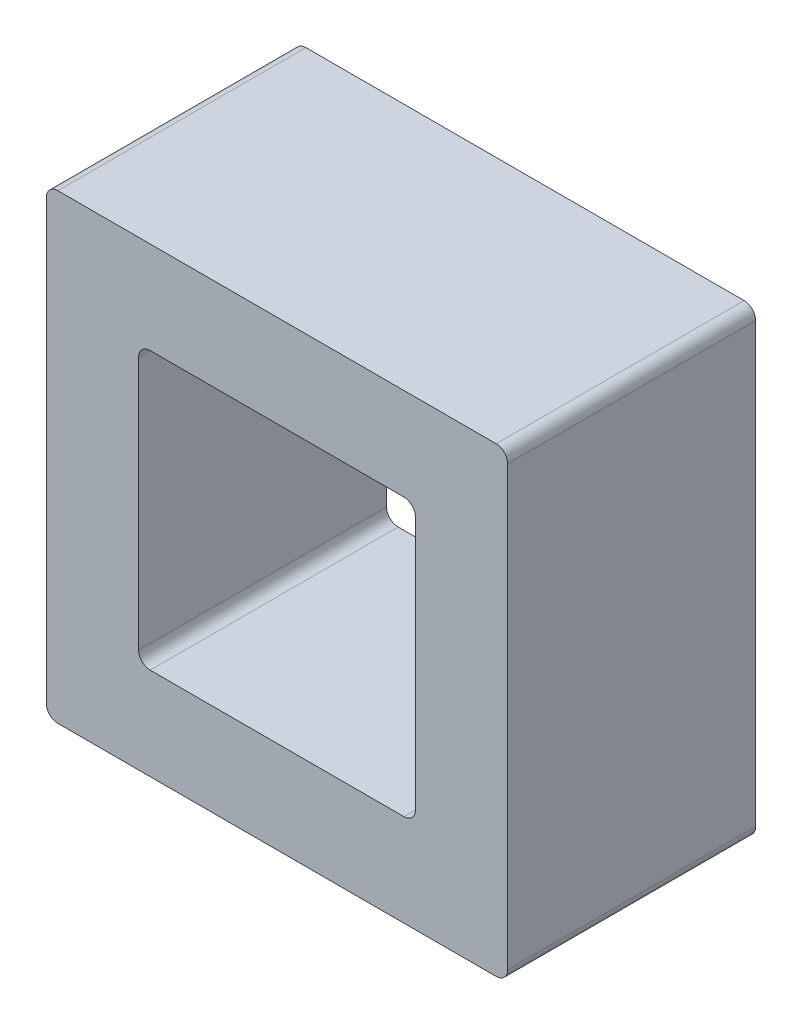
ISO-10303-21;
HEADER;
FILE_DESCRIPTION(('STEP AP214'),'2;1');
FILE_NAME('part.step','',(''),(''),'','','');
FILE_SCHEMA(('AUTOMOTIVE_DESIGN { 1 0 10303 214 1 1 1 1 }'));
ENDSEC;
DATA;
#1=APPLICATION_CONTEXT('core data for automotive mechanical design processes');
#2=APPLICATION_PROTOCOL_DEFINITION('international standard','automotive_design',2000,#1);
#3=PRODUCT_CONTEXT('',#1,'mechanical');
#4=PRODUCT('Part','Part','',(#3));
#5=PRODUCT_RELATED_PRODUCT_CATEGORY('part','',(#4));
#6=PRODUCT_DEFINITION_FORMATION('','',#4);
#7=PRODUCT_DEFINITION_CONTEXT('part definition',#1,'design');
#8=PRODUCT_DEFINITION('design','',#6,#7);
#9=PRODUCT_DEFINITION_SHAPE('','',#8);
#10=(LENGTH_UNIT() NAMED_UNIT(*) SI_UNIT(.MILLI.,.METRE.));
#11=(NAMED_UNIT(*) PLANE_ANGLE_UNIT() SI_UNIT($,.RADIAN.));
#12=(NAMED_UNIT(*) SI_UNIT($,.STERADIAN.) SOLID_ANGLE_UNIT());
#13=UNCERTAINTY_MEASURE_WITH_UNIT(LENGTH_MEASURE(1.E-05),#10,'distance_accuracy_value','');
#14=(GEOMETRIC_REPRESENTATION_CONTEXT(3) GLOBAL_UNCERTAINTY_ASSIGNED_CONTEXT((#13)) GLOBAL_UNIT_ASSIGNED_CONTEXT((#10,
#11,#12)) REPRESENTATION_CONTEXT('',''));
#15=CARTESIAN_POINT('',(0.,0.,0.));
#16=DIRECTION('',(0.,0.,1.));
#17=DIRECTION('',(1.,0.,0.));
#18=AXIS2_PLACEMENT_3D('',#15,#16,#17);
#19=CARTESIAN_POINT('',(0.,0.,4.3));
#20=DIRECTION('',(0.,0.,-1.));
#21=DIRECTION('',(-1.,0.,0.));
#22=AXIS2_PLACEMENT_3D('',#19,#20,#21);
#23=PLANE('',#22);
#24=DIRECTION('',(1.,0.,0.));
#25=VECTOR('',#24,1.);
#26=CARTESIAN_POINT('',(0.,0.,4.3));
#27=LINE('',#26,#25);
#28=CARTESIAN_POINT('',(0.2,0.,4.3));
#29=VERTEX_POINT('',#28);
#30=CARTESIAN_POINT('',(7.8,0.,4.3));
#31=VERTEX_POINT('',#30);
#32=EDGE_CURVE('E334',#29,#31,#27,.T.);
#33=ORIENTED_EDGE('',*,*,#32,.T.);
#34=CARTESIAN_POINT('',(7.8,0.2,4.3));
#35=DIRECTION('',(0.,0.,-1.));
#36=DIRECTION('',(-1.,0.,0.));
#37=AXIS2_PLACEMENT_3D('',#34,#35,#36);
#38=CIRCLE('',#37,0.2);
#39=CARTESIAN_POINT('',(8.,0.2,4.3));
#40=VERTEX_POINT('',#39);
#41=EDGE_CURVE('E224',#31,#40,#38,.F.);
#42=ORIENTED_EDGE('',*,*,#41,.T.);
#43=DIRECTION('',(0.,1.,0.));
#44=VECTOR('',#43,1.);
#45=CARTESIAN_POINT('',(8.,0.,4.3));
#46=LINE('',#45,#44);
#47=CARTESIAN_POINT('',(8.,7.79999999999999,4.3));
#48=VERTEX_POINT('',#47);
#49=EDGE_CURVE('E179',#40,#48,#46,.T.);
#50=ORIENTED_EDGE('',*,*,#49,.T.);
#51=CARTESIAN_POINT('',(7.8,7.79999999999999,4.3));
#52=DIRECTION('',(0.,0.,-1.));
#53=DIRECTION('',(-1.,0.,0.));
#54=AXIS2_PLACEMENT_3D('',#51,#52,#53);
#55=CIRCLE('',#54,0.2);
#56=CARTESIAN_POINT('',(7.8,7.99999999999999,4.3));
#57=VERTEX_POINT('',#56);
#58=EDGE_CURVE('E218',#48,#57,#55,.F.);
#59=ORIENTED_EDGE('',*,*,#58,.T.);
#60=DIRECTION('',(-1.,0.,0.));
#61=VECTOR('',#60,1.);
#62=CARTESIAN_POINT('',(0.,7.99999999999999,4.3));
#63=LINE('',#62,#61);
#64=CARTESIAN_POINT('',(0.2,7.99999999999999,4.3));
#65=VERTEX_POINT('',#64);
#66=EDGE_CURVE('E202',#57,#65,#63,.T.);
#67=ORIENTED_EDGE('',*,*,#66,.T.);
#68=CARTESIAN_POINT('',(0.2,7.79999999999999,4.3));
#69=DIRECTION('',(0.,0.,-1.));
#70=DIRECTION('',(-1.,0.,0.));
#71=AXIS2_PLACEMENT_3D('',#68,#69,#70);
#72=CIRCLE('',#71,0.2);
#73=CARTESIAN_POINT('',(0.,7.79999999999999,4.3));
#74=VERTEX_POINT('',#73);
#75=EDGE_CURVE('E215',#65,#74,#72,.F.);
#76=ORIENTED_EDGE('',*,*,#75,.T.);
#77=DIRECTION('',(0.,-1.,0.));
#78=VECTOR('',#77,1.);
#79=CARTESIAN_POINT('',(0.,0.,4.3));
#80=LINE('',#79,#78);
#81=CARTESIAN_POINT('',(0.,0.2,4.3));
#82=VERTEX_POINT('',#81);
#83=EDGE_CURVE('E195',#74,#82,#80,.T.);
#84=ORIENTED_EDGE('',*,*,#83,.T.);
#85=CARTESIAN_POINT('',(0.2,0.2,4.3));
#86=DIRECTION('',(0.,0.,-1.));
#87=DIRECTION('',(-1.,0.,0.));
#88=AXIS2_PLACEMENT_3D('',#85,#86,#87);
#89=CIRCLE('',#88,0.2);
#90=EDGE_CURVE('E221',#82,#29,#89,.F.);
#91=ORIENTED_EDGE('',*,*,#90,.T.);
#92=EDGE_LOOP('',(#33,#42,#50,#59,#67,#76,#84,#91));
#93=FACE_BOUND('',#92,.T.);
#94=DIRECTION('',(0.,-1.,0.));
#95=VECTOR('',#94,1.);
#96=CARTESIAN_POINT('',(1.60000000000001,6.39999999999999,4.3));
#97=LINE('',#96,#95);
#98=CARTESIAN_POINT('',(1.60000000000001,6.19999999999999,4.3));
#99=VERTEX_POINT('',#98);
#100=CARTESIAN_POINT('',(1.6,1.8,4.3));
#101=VERTEX_POINT('',#100);
#102=EDGE_CURVE('E308',#99,#101,#97,.T.);
#103=ORIENTED_EDGE('',*,*,#102,.F.);
#104=CARTESIAN_POINT('',(1.80000000000001,6.19999999999999,4.3));
#105=DIRECTION('',(0.,0.,-1.));
#106=DIRECTION('',(-1.,0.,0.));
#107=AXIS2_PLACEMENT_3D('',#104,#105,#106);
#108=CIRCLE('',#107,0.2);
#109=CARTESIAN_POINT('',(1.80000000000001,6.39999999999999,4.3));
#110=VERTEX_POINT('',#109);
#111=EDGE_CURVE('E11',#99,#110,#108,.T.);
#112=ORIENTED_EDGE('',*,*,#111,.T.);
#113=DIRECTION('',(-1.,0.,0.));
#114=VECTOR('',#113,1.);
#115=CARTESIAN_POINT('',(1.60000000000001,6.39999999999999,4.3));
#116=LINE('',#115,#114);
#117=CARTESIAN_POINT('',(6.19999999999999,6.39999999999999,4.3));
#118=VERTEX_POINT('',#117);
#119=EDGE_CURVE('E306',#118,#110,#116,.T.);
#120=ORIENTED_EDGE('',*,*,#119,.F.);
#121=CARTESIAN_POINT('',(6.19999999999999,6.19999999999999,4.3));
#122=DIRECTION('',(0.,0.,-1.));
#123=DIRECTION('',(-1.,0.,0.));
#124=AXIS2_PLACEMENT_3D('',#121,#122,#123);
#125=CIRCLE('',#124,0.2);
#126=CARTESIAN_POINT('',(6.39999999999999,6.19999999999999,4.3));
#127=VERTEX_POINT('',#126);
#128=EDGE_CURVE('E276',#118,#127,#125,.T.);
#129=ORIENTED_EDGE('',*,*,#128,.T.);
#130=DIRECTION('',(0.,1.,0.));
#131=VECTOR('',#130,1.);
#132=CARTESIAN_POINT('',(6.39999999999999,6.39999999999999,4.3));
#133=LINE('',#132,#131);
#134=CARTESIAN_POINT('',(6.4,1.8,4.3));
#135=VERTEX_POINT('',#134);
#136=EDGE_CURVE('E313',#135,#127,#133,.T.);
#137=ORIENTED_EDGE('',*,*,#136,.F.);
#138=CARTESIAN_POINT('',(6.2,1.8,4.3));
#139=DIRECTION('',(0.,0.,-1.));
#140=DIRECTION('',(-1.,0.,0.));
#141=AXIS2_PLACEMENT_3D('',#138,#139,#140);
#142=CIRCLE('',#141,0.2);
#143=CARTESIAN_POINT('',(6.2,1.6,4.3));
#144=VERTEX_POINT('',#143);
#145=EDGE_CURVE('E59',#135,#144,#142,.T.);
#146=ORIENTED_EDGE('',*,*,#145,.T.);
#147=DIRECTION('',(1.,0.,0.));
#148=VECTOR('',#147,1.);
#149=CARTESIAN_POINT('',(1.6,1.6,4.3));
#150=LINE('',#149,#148);
#151=CARTESIAN_POINT('',(1.8,1.6,4.3));
#152=VERTEX_POINT('',#151);
#153=EDGE_CURVE('E319',#152,#144,#150,.T.);
#154=ORIENTED_EDGE('',*,*,#153,.F.);
#155=CARTESIAN_POINT('',(1.8,1.8,4.3));
#156=DIRECTION('',(0.,0.,-1.));
#157=DIRECTION('',(-1.,0.,0.));
#158=AXIS2_PLACEMENT_3D('',#155,#156,#157);
#159=CIRCLE('',#158,0.2);
#160=EDGE_CURVE('E282',#152,#101,#159,.T.);
#161=ORIENTED_EDGE('',*,*,#160,.T.);
#162=EDGE_LOOP('',(#103,#112,#120,#129,#137,#146,#154,#161));
#163=FACE_BOUND('',#162,.T.);
#164=ADVANCED_FACE('F43',(#93,#163),#23,.F.);
#165=CARTESIAN_POINT('',(0.,0.,0.));
#166=DIRECTION('',(0.,0.,-1.));
#167=DIRECTION('',(-1.,0.,0.));
#168=AXIS2_PLACEMENT_3D('',#165,#166,#167);
#169=PLANE('',#168);
#170=DIRECTION('',(0.,1.,0.));
#171=VECTOR('',#170,1.);
#172=CARTESIAN_POINT('',(8.,0.,0.));
#173=LINE('',#172,#171);
#174=CARTESIAN_POINT('',(8.,0.2,0.));
#175=VERTEX_POINT('',#174);
#176=CARTESIAN_POINT('',(8.,7.79999999999999,0.));
#177=VERTEX_POINT('',#176);
#178=EDGE_CURVE('E176',#175,#177,#173,.T.);
#179=ORIENTED_EDGE('',*,*,#178,.F.);
#180=CARTESIAN_POINT('',(7.8,0.2,0.));
#181=DIRECTION('',(0.,0.,-1.));
#182=DIRECTION('',(-1.,0.,0.));
#183=AXIS2_PLACEMENT_3D('',#180,#181,#182);
#184=CIRCLE('',#183,0.2);
#185=CARTESIAN_POINT('',(7.8,0.,0.));
#186=VERTEX_POINT('',#185);
#187=EDGE_CURVE('E158',#175,#186,#184,.T.);
#188=ORIENTED_EDGE('',*,*,#187,.T.);
#189=DIRECTION('',(1.,0.,0.));
#190=VECTOR('',#189,1.);
#191=CARTESIAN_POINT('',(0.,0.,0.));
#192=LINE('',#191,#190);
#193=CARTESIAN_POINT('',(0.2,0.,0.));
#194=VERTEX_POINT('',#193);
#195=EDGE_CURVE('E190',#194,#186,#192,.T.);
#196=ORIENTED_EDGE('',*,*,#195,.F.);
#197=CARTESIAN_POINT('',(0.2,0.2,0.));
#198=DIRECTION('',(0.,0.,-1.));
#199=DIRECTION('',(-1.,0.,0.));
#200=AXIS2_PLACEMENT_3D('',#197,#198,#199);
#201=CIRCLE('',#200,0.2);
#202=CARTESIAN_POINT('',(0.,0.2,0.));
#203=VERTEX_POINT('',#202);
#204=EDGE_CURVE('E170',#194,#203,#201,.T.);
#205=ORIENTED_EDGE('',*,*,#204,.T.);
#206=DIRECTION('',(0.,-1.,0.));
#207=VECTOR('',#206,1.);
#208=CARTESIAN_POINT('',(0.,0.,0.));
#209=LINE('',#208,#207);
#210=CARTESIAN_POINT('',(0.,7.79999999999999,0.));
#211=VERTEX_POINT('',#210);
#212=EDGE_CURVE('E197',#211,#203,#209,.T.);
#213=ORIENTED_EDGE('',*,*,#212,.F.);
#214=CARTESIAN_POINT('',(0.2,7.79999999999999,0.));
#215=DIRECTION('',(0.,0.,-1.));
#216=DIRECTION('',(-1.,0.,0.));
#217=AXIS2_PLACEMENT_3D('',#214,#215,#216);
#218=CIRCLE('',#217,0.2);
#219=CARTESIAN_POINT('',(0.2,7.99999999999999,0.));
#220=VERTEX_POINT('',#219);
#221=EDGE_CURVE('E181',#211,#220,#218,.T.);
#222=ORIENTED_EDGE('',*,*,#221,.T.);
#223=DIRECTION('',(-1.,0.,0.));
#224=VECTOR('',#223,1.);
#225=CARTESIAN_POINT('',(0.,7.99999999999999,0.));
#226=LINE('',#225,#224);
#227=CARTESIAN_POINT('',(7.8,7.99999999999999,0.));
#228=VERTEX_POINT('',#227);
#229=EDGE_CURVE('E189',#228,#220,#226,.T.);
#230=ORIENTED_EDGE('',*,*,#229,.F.);
#231=CARTESIAN_POINT('',(7.8,7.79999999999999,0.));
#232=DIRECTION('',(0.,0.,-1.));
#233=DIRECTION('',(-1.,0.,0.));
#234=AXIS2_PLACEMENT_3D('',#231,#232,#233);
#235=CIRCLE('',#234,0.2);
#236=EDGE_CURVE('E187',#228,#177,#235,.T.);
#237=ORIENTED_EDGE('',*,*,#236,.T.);
#238=EDGE_LOOP('',(#179,#188,#196,#205,#213,#222,#230,#237));
#239=FACE_BOUND('',#238,.T.);
#240=DIRECTION('',(0.,1.,0.));
#241=VECTOR('',#240,1.);
#242=CARTESIAN_POINT('',(6.39999999999999,6.39999999999999,0.));
#243=LINE('',#242,#241);
#244=CARTESIAN_POINT('',(6.4,1.8,0.));
#245=VERTEX_POINT('',#244);
#246=CARTESIAN_POINT('',(6.39999999999999,6.19999999999999,0.));
#247=VERTEX_POINT('',#246);
#248=EDGE_CURVE('E326',#245,#247,#243,.T.);
#249=ORIENTED_EDGE('',*,*,#248,.T.);
#250=CARTESIAN_POINT('',(6.19999999999999,6.19999999999999,0.));
#251=DIRECTION('',(0.,0.,-1.));
#252=DIRECTION('',(-1.,0.,0.));
#253=AXIS2_PLACEMENT_3D('',#250,#251,#252);
#254=CIRCLE('',#253,0.2);
#255=CARTESIAN_POINT('',(6.19999999999999,6.39999999999999,0.));
#256=VERTEX_POINT('',#255);
#257=EDGE_CURVE('E273',#247,#256,#254,.F.);
#258=ORIENTED_EDGE('',*,*,#257,.T.);
#259=DIRECTION('',(-1.,0.,0.));
#260=VECTOR('',#259,1.);
#261=CARTESIAN_POINT('',(1.60000000000001,6.39999999999999,0.));
#262=LINE('',#261,#260);
#263=CARTESIAN_POINT('',(1.80000000000001,6.39999999999999,0.));
#264=VERTEX_POINT('',#263);
#265=EDGE_CURVE('E291',#256,#264,#262,.T.);
#266=ORIENTED_EDGE('',*,*,#265,.T.);
#267=CARTESIAN_POINT('',(1.80000000000001,6.19999999999999,0.));
#268=DIRECTION('',(0.,0.,-1.));
#269=DIRECTION('',(-1.,0.,0.));
#270=AXIS2_PLACEMENT_3D('',#267,#268,#269);
#271=CIRCLE('',#270,0.2);
#272=CARTESIAN_POINT('',(1.60000000000001,6.19999999999999,0.));
#273=VERTEX_POINT('',#272);
#274=EDGE_CURVE('E52',#264,#273,#271,.F.);
#275=ORIENTED_EDGE('',*,*,#274,.T.);
#276=DIRECTION('',(0.,-1.,0.));
#277=VECTOR('',#276,1.);
#278=CARTESIAN_POINT('',(1.60000000000001,6.39999999999999,0.));
#279=LINE('',#278,#277);
#280=CARTESIAN_POINT('',(1.6,1.8,0.));
#281=VERTEX_POINT('',#280);
#282=EDGE_CURVE('E289',#273,#281,#279,.T.);
#283=ORIENTED_EDGE('',*,*,#282,.T.);
#284=CARTESIAN_POINT('',(1.8,1.8,0.));
#285=DIRECTION('',(0.,0.,-1.));
#286=DIRECTION('',(-1.,0.,0.));
#287=AXIS2_PLACEMENT_3D('',#284,#285,#286);
#288=CIRCLE('',#287,0.2);
#289=CARTESIAN_POINT('',(1.8,1.6,0.));
#290=VERTEX_POINT('',#289);
#291=EDGE_CURVE('E279',#281,#290,#288,.F.);
#292=ORIENTED_EDGE('',*,*,#291,.T.);
#293=DIRECTION('',(1.,0.,0.));
#294=VECTOR('',#293,1.);
#295=CARTESIAN_POINT('',(1.6,1.6,0.));
#296=LINE('',#295,#294);
#297=CARTESIAN_POINT('',(6.2,1.6,0.));
#298=VERTEX_POINT('',#297);
#299=EDGE_CURVE('E301',#290,#298,#296,.T.);
#300=ORIENTED_EDGE('',*,*,#299,.T.);
#301=CARTESIAN_POINT('',(6.2,1.8,0.));
#302=DIRECTION('',(0.,0.,-1.));
#303=DIRECTION('',(-1.,0.,0.));
#304=AXIS2_PLACEMENT_3D('',#301,#302,#303);
#305=CIRCLE('',#304,0.2);
#306=EDGE_CURVE('E268',#298,#245,#305,.F.);
#307=ORIENTED_EDGE('',*,*,#306,.T.);
#308=EDGE_LOOP('',(#249,#258,#266,#275,#283,#292,#300,#307));
#309=FACE_BOUND('',#308,.T.);
#310=ADVANCED_FACE('F184',(#239,#309),#169,.T.);
#311=CARTESIAN_POINT('',(0.,0.,4.3));
#312=DIRECTION('',(1.,0.,0.));
#313=DIRECTION('',(0.,0.,-1.));
#314=AXIS2_PLACEMENT_3D('',#311,#312,#313);
#315=PLANE('',#314);
#316=ORIENTED_EDGE('',*,*,#212,.T.);
#317=DIRECTION('',(0.,0.,-1.));
#318=VECTOR('',#317,1.);
#319=CARTESIAN_POINT('',(0.,0.2,4.3));
#320=LINE('',#319,#318);
#321=EDGE_CURVE('E231',#203,#82,#320,.F.);
#322=ORIENTED_EDGE('',*,*,#321,.T.);
#323=ORIENTED_EDGE('',*,*,#83,.F.);
#324=DIRECTION('',(0.,0.,-1.));
#325=VECTOR('',#324,1.);
#326=CARTESIAN_POINT('',(0.,7.79999999999999,4.3));
#327=LINE('',#326,#325);
#328=EDGE_CURVE('E227',#74,#211,#327,.T.);
#329=ORIENTED_EDGE('',*,*,#328,.T.);
#330=EDGE_LOOP('',(#316,#322,#323,#329));
#331=FACE_BOUND('',#330,.T.);
#332=ADVANCED_FACE('F355',(#331),#315,.F.);
#333=CARTESIAN_POINT('',(0.,0.,4.3));
#334=DIRECTION('',(0.,1.,0.));
#335=DIRECTION('',(0.,0.,1.));
#336=AXIS2_PLACEMENT_3D('',#333,#334,#335);
#337=PLANE('',#336);
#338=ORIENTED_EDGE('',*,*,#195,.T.);
#339=DIRECTION('',(0.,0.,-1.));
#340=VECTOR('',#339,1.);
#341=CARTESIAN_POINT('',(7.8,0.,4.3));
#342=LINE('',#341,#340);
#343=EDGE_CURVE('E163',#186,#31,#342,.F.);
#344=ORIENTED_EDGE('',*,*,#343,.T.);
#345=ORIENTED_EDGE('',*,*,#32,.F.);
#346=DIRECTION('',(0.,0.,-1.));
#347=VECTOR('',#346,1.);
#348=CARTESIAN_POINT('',(0.2,0.,4.3));
#349=LINE('',#348,#347);
#350=EDGE_CURVE('E169',#29,#194,#349,.T.);
#351=ORIENTED_EDGE('',*,*,#350,.T.);
#352=EDGE_LOOP('',(#338,#344,#345,#351));
#353=FACE_BOUND('',#352,.T.);
#354=ADVANCED_FACE('F363',(#353),#337,.F.);
#355=CARTESIAN_POINT('',(8.,0.,4.3));
#356=DIRECTION('',(-1.,0.,0.));
#357=DIRECTION('',(0.,0.,1.));
#358=AXIS2_PLACEMENT_3D('',#355,#356,#357);
#359=PLANE('',#358);
#360=ORIENTED_EDGE('',*,*,#49,.F.);
#361=DIRECTION('',(0.,0.,-1.));
#362=VECTOR('',#361,1.);
#363=CARTESIAN_POINT('',(8.,0.2,4.3));
#364=LINE('',#363,#362);
#365=EDGE_CURVE('E162',#40,#175,#364,.T.);
#366=ORIENTED_EDGE('',*,*,#365,.T.);
#367=ORIENTED_EDGE('',*,*,#178,.T.);
#368=DIRECTION('',(0.,0.,-1.));
#369=VECTOR('',#368,1.);
#370=CARTESIAN_POINT('',(8.,7.79999999999999,4.3));
#371=LINE('',#370,#369);
#372=EDGE_CURVE('E182',#177,#48,#371,.F.);
#373=ORIENTED_EDGE('',*,*,#372,.T.);
#374=EDGE_LOOP('',(#360,#366,#367,#373));
#375=FACE_BOUND('',#374,.T.);
#376=ADVANCED_FACE('F175',(#375),#359,.F.);
#377=CARTESIAN_POINT('',(0.,7.99999999999999,4.3));
#378=DIRECTION('',(0.,-1.,0.));
#379=DIRECTION('',(0.,0.,-1.));
#380=AXIS2_PLACEMENT_3D('',#377,#378,#379);
#381=PLANE('',#380);
#382=ORIENTED_EDGE('',*,*,#66,.F.);
#383=DIRECTION('',(0.,0.,-1.));
#384=VECTOR('',#383,1.);
#385=CARTESIAN_POINT('',(7.8,7.99999999999999,4.3));
#386=LINE('',#385,#384);
#387=EDGE_CURVE('E237',#57,#228,#386,.T.);
#388=ORIENTED_EDGE('',*,*,#387,.T.);
#389=ORIENTED_EDGE('',*,*,#229,.T.);
#390=DIRECTION('',(0.,0.,-1.));
#391=VECTOR('',#390,1.);
#392=CARTESIAN_POINT('',(0.2,7.99999999999999,4.3));
#393=LINE('',#392,#391);
#394=EDGE_CURVE('E234',#220,#65,#393,.F.);
#395=ORIENTED_EDGE('',*,*,#394,.T.);
#396=EDGE_LOOP('',(#382,#388,#389,#395));
#397=FACE_BOUND('',#396,.T.);
#398=ADVANCED_FACE('F366',(#397),#381,.F.);
#399=CARTESIAN_POINT('',(1.60000000000001,6.39999999999999,4.3));
#400=DIRECTION('',(1.,0.,0.));
#401=DIRECTION('',(0.,1.,0.));
#402=AXIS2_PLACEMENT_3D('',#399,#400,#401);
#403=PLANE('',#402);
#404=ORIENTED_EDGE('',*,*,#102,.T.);
#405=DIRECTION('',(0.,0.,-1.));
#406=VECTOR('',#405,1.);
#407=CARTESIAN_POINT('',(1.6,1.8,0.));
#408=LINE('',#407,#406);
#409=EDGE_CURVE('E264',#101,#281,#408,.T.);
#410=ORIENTED_EDGE('',*,*,#409,.T.);
#411=ORIENTED_EDGE('',*,*,#282,.F.);
#412=DIRECTION('',(0.,0.,-1.));
#413=VECTOR('',#412,1.);
#414=CARTESIAN_POINT('',(1.60000000000001,6.19999999999999,4.3));
#415=LINE('',#414,#413);
#416=EDGE_CURVE('E261',#273,#99,#415,.F.);
#417=ORIENTED_EDGE('',*,*,#416,.T.);
#418=EDGE_LOOP('',(#404,#410,#411,#417));
#419=FACE_BOUND('',#418,.T.);
#420=ADVANCED_FACE('F297',(#419),#403,.T.);
#421=CARTESIAN_POINT('',(1.6,1.6,4.3));
#422=DIRECTION('',(0.,1.,0.));
#423=DIRECTION('',(-1.,0.,0.));
#424=AXIS2_PLACEMENT_3D('',#421,#422,#423);
#425=PLANE('',#424);
#426=ORIENTED_EDGE('',*,*,#153,.T.);
#427=DIRECTION('',(0.,0.,-1.));
#428=VECTOR('',#427,1.);
#429=CARTESIAN_POINT('',(6.2,1.6,0.));
#430=LINE('',#429,#428);
#431=EDGE_CURVE('E243',#144,#298,#430,.T.);
#432=ORIENTED_EDGE('',*,*,#431,.T.);
#433=ORIENTED_EDGE('',*,*,#299,.F.);
#434=DIRECTION('',(0.,0.,-1.));
#435=VECTOR('',#434,1.);
#436=CARTESIAN_POINT('',(1.8,1.6,4.3));
#437=LINE('',#436,#435);
#438=EDGE_CURVE('E66',#290,#152,#437,.F.);
#439=ORIENTED_EDGE('',*,*,#438,.T.);
#440=EDGE_LOOP('',(#426,#432,#433,#439));
#441=FACE_BOUND('',#440,.T.);
#442=ADVANCED_FACE('F373',(#441),#425,.T.);
#443=CARTESIAN_POINT('',(6.39999999999999,6.39999999999999,4.3));
#444=DIRECTION('',(-1.,0.,0.));
#445=DIRECTION('',(0.,-1.,0.));
#446=AXIS2_PLACEMENT_3D('',#443,#444,#445);
#447=PLANE('',#446);
#448=ORIENTED_EDGE('',*,*,#248,.F.);
#449=DIRECTION('',(0.,0.,-1.));
#450=VECTOR('',#449,1.);
#451=CARTESIAN_POINT('',(6.4,1.8,4.3));
#452=LINE('',#451,#450);
#453=EDGE_CURVE('E251',#245,#135,#452,.F.);
#454=ORIENTED_EDGE('',*,*,#453,.T.);
#455=ORIENTED_EDGE('',*,*,#136,.T.);
#456=DIRECTION('',(0.,0.,-1.));
#457=VECTOR('',#456,1.);
#458=CARTESIAN_POINT('',(6.39999999999999,6.19999999999999,0.));
#459=LINE('',#458,#457);
#460=EDGE_CURVE('E247',#127,#247,#459,.T.);
#461=ORIENTED_EDGE('',*,*,#460,.T.);
#462=EDGE_LOOP('',(#448,#454,#455,#461));
#463=FACE_BOUND('',#462,.T.);
#464=ADVANCED_FACE('F385',(#463),#447,.T.);
#465=CARTESIAN_POINT('',(1.60000000000001,6.39999999999999,4.3));
#466=DIRECTION('',(0.,-1.,0.));
#467=DIRECTION('',(0.,0.,-1.));
#468=AXIS2_PLACEMENT_3D('',#465,#466,#467);
#469=PLANE('',#468);
#470=ORIENTED_EDGE('',*,*,#265,.F.);
#471=DIRECTION('',(0.,0.,-1.));
#472=VECTOR('',#471,1.);
#473=CARTESIAN_POINT('',(6.19999999999999,6.39999999999999,4.3));
#474=LINE('',#473,#472);
#475=EDGE_CURVE('E258',#256,#118,#474,.F.);
#476=ORIENTED_EDGE('',*,*,#475,.T.);
#477=ORIENTED_EDGE('',*,*,#119,.T.);
#478=DIRECTION('',(0.,0.,-1.));
#479=VECTOR('',#478,1.);
#480=CARTESIAN_POINT('',(1.80000000000001,6.39999999999999,0.));
#481=LINE('',#480,#479);
#482=EDGE_CURVE('E254',#110,#264,#481,.T.);
#483=ORIENTED_EDGE('',*,*,#482,.T.);
#484=EDGE_LOOP('',(#470,#476,#477,#483));
#485=FACE_BOUND('',#484,.T.);
#486=ADVANCED_FACE('F310',(#485),#469,.T.);
#487=CARTESIAN_POINT('',(7.8,0.2,4.3));
#488=DIRECTION('',(0.,0.,-1.));
#489=DIRECTION('',(-1.,0.,0.));
#490=AXIS2_PLACEMENT_3D('',#487,#488,#489);
#491=CYLINDRICAL_SURFACE('',#490,0.2);
#492=ORIENTED_EDGE('',*,*,#41,.F.);
#493=ORIENTED_EDGE('',*,*,#343,.F.);
#494=ORIENTED_EDGE('',*,*,#187,.F.);
#495=ORIENTED_EDGE('',*,*,#365,.F.);
#496=EDGE_LOOP('',(#492,#493,#494,#495));
#497=FACE_BOUND('',#496,.T.);
#498=ADVANCED_FACE('F161',(#497),#491,.T.);
#499=CARTESIAN_POINT('',(0.2,0.2,4.3));
#500=DIRECTION('',(0.,0.,-1.));
#501=DIRECTION('',(-1.,0.,0.));
#502=AXIS2_PLACEMENT_3D('',#499,#500,#501);
#503=CYLINDRICAL_SURFACE('',#502,0.2);
#504=ORIENTED_EDGE('',*,*,#90,.F.);
#505=ORIENTED_EDGE('',*,*,#321,.F.);
#506=ORIENTED_EDGE('',*,*,#204,.F.);
#507=ORIENTED_EDGE('',*,*,#350,.F.);
#508=EDGE_LOOP('',(#504,#505,#506,#507));
#509=FACE_BOUND('',#508,.T.);
#510=ADVANCED_FACE('F360',(#509),#503,.T.);
#511=CARTESIAN_POINT('',(7.8,7.79999999999999,4.3));
#512=DIRECTION('',(0.,0.,-1.));
#513=DIRECTION('',(-1.,0.,0.));
#514=AXIS2_PLACEMENT_3D('',#511,#512,#513);
#515=CYLINDRICAL_SURFACE('',#514,0.2);
#516=ORIENTED_EDGE('',*,*,#58,.F.);
#517=ORIENTED_EDGE('',*,*,#372,.F.);
#518=ORIENTED_EDGE('',*,*,#236,.F.);
#519=ORIENTED_EDGE('',*,*,#387,.F.);
#520=EDGE_LOOP('',(#516,#517,#518,#519));
#521=FACE_BOUND('',#520,.T.);
#522=ADVANCED_FACE('F365',(#521),#515,.T.);
#523=CARTESIAN_POINT('',(0.2,7.79999999999999,4.3));
#524=DIRECTION('',(0.,0.,-1.));
#525=DIRECTION('',(-1.,0.,0.));
#526=AXIS2_PLACEMENT_3D('',#523,#524,#525);
#527=CYLINDRICAL_SURFACE('',#526,0.2);
#528=ORIENTED_EDGE('',*,*,#75,.F.);
#529=ORIENTED_EDGE('',*,*,#394,.F.);
#530=ORIENTED_EDGE('',*,*,#221,.F.);
#531=ORIENTED_EDGE('',*,*,#328,.F.);
#532=EDGE_LOOP('',(#528,#529,#530,#531));
#533=FACE_BOUND('',#532,.T.);
#534=ADVANCED_FACE('F352',(#533),#527,.T.);
#535=CARTESIAN_POINT('',(6.2,1.8,4.3));
#536=DIRECTION('',(0.,0.,1.));
#537=DIRECTION('',(1.,0.,0.));
#538=AXIS2_PLACEMENT_3D('',#535,#536,#537);
#539=CYLINDRICAL_SURFACE('',#538,0.2);
#540=ORIENTED_EDGE('',*,*,#145,.F.);
#541=ORIENTED_EDGE('',*,*,#453,.F.);
#542=ORIENTED_EDGE('',*,*,#306,.F.);
#543=ORIENTED_EDGE('',*,*,#431,.F.);
#544=EDGE_LOOP('',(#540,#541,#542,#543));
#545=FACE_BOUND('',#544,.T.);
#546=ADVANCED_FACE('F405',(#545),#539,.F.);
#547=CARTESIAN_POINT('',(6.19999999999999,6.19999999999999,4.3));
#548=DIRECTION('',(0.,0.,1.));
#549=DIRECTION('',(1.,0.,0.));
#550=AXIS2_PLACEMENT_3D('',#547,#548,#549);
#551=CYLINDRICAL_SURFACE('',#550,0.2);
#552=ORIENTED_EDGE('',*,*,#128,.F.);
#553=ORIENTED_EDGE('',*,*,#475,.F.);
#554=ORIENTED_EDGE('',*,*,#257,.F.);
#555=ORIENTED_EDGE('',*,*,#460,.F.);
#556=EDGE_LOOP('',(#552,#553,#554,#555));
#557=FACE_BOUND('',#556,.T.);
#558=ADVANCED_FACE('F408',(#557),#551,.F.);
#559=CARTESIAN_POINT('',(1.8,1.8,4.3));
#560=DIRECTION('',(0.,0.,1.));
#561=DIRECTION('',(1.,0.,0.));
#562=AXIS2_PLACEMENT_3D('',#559,#560,#561);
#563=CYLINDRICAL_SURFACE('',#562,0.2);
#564=ORIENTED_EDGE('',*,*,#160,.F.);
#565=ORIENTED_EDGE('',*,*,#438,.F.);
#566=ORIENTED_EDGE('',*,*,#291,.F.);
#567=ORIENTED_EDGE('',*,*,#409,.F.);
#568=EDGE_LOOP('',(#564,#565,#566,#567));
#569=FACE_BOUND('',#568,.T.);
#570=ADVANCED_FACE('F411',(#569),#563,.F.);
#571=CARTESIAN_POINT('',(1.80000000000001,6.19999999999999,4.3));
#572=DIRECTION('',(0.,0.,1.));
#573=DIRECTION('',(1.,0.,0.));
#574=AXIS2_PLACEMENT_3D('',#571,#572,#573);
#575=CYLINDRICAL_SURFACE('',#574,0.2);
#576=ORIENTED_EDGE('',*,*,#111,.F.);
#577=ORIENTED_EDGE('',*,*,#416,.F.);
#578=ORIENTED_EDGE('',*,*,#274,.F.);
#579=ORIENTED_EDGE('',*,*,#482,.F.);
#580=EDGE_LOOP('',(#576,#577,#578,#579));
#581=FACE_BOUND('',#580,.T.);
#582=ADVANCED_FACE('F45',(#581),#575,.F.);
#583=CLOSED_SHELL('',(#164,#310,#332,#354,#376,#398,#420,#442,#464,#486,#498,#510,#522,#534,
#546,#558,#570,#582));
#584=MANIFOLD_SOLID_BREP('B2',#583);
#585=ADVANCED_BREP_SHAPE_REPRESENTATION('',(#18,#584),#14);
#586=SHAPE_DEFINITION_REPRESENTATION(#9,#585);
ENDSEC;
END-ISO-10303-21;
